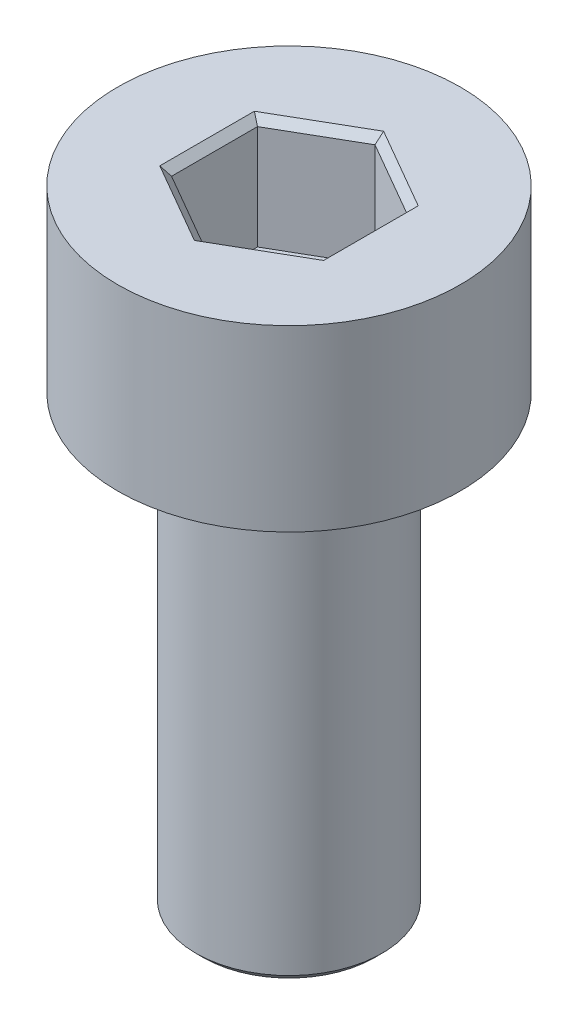
ISO-10303-21;
HEADER;
FILE_DESCRIPTION(('STEP AP214'),'2;1');
FILE_NAME('part.step','',(''),(''),'','','');
FILE_SCHEMA(('AUTOMOTIVE_DESIGN { 1 0 10303 214 1 1 1 1 }'));
ENDSEC;
DATA;
#1=APPLICATION_CONTEXT('core data for automotive mechanical design processes');
#2=APPLICATION_PROTOCOL_DEFINITION('international standard','automotive_design',2000,#1);
#3=PRODUCT_CONTEXT('',#1,'mechanical');
#4=PRODUCT('Part','Part','',(#3));
#5=PRODUCT_RELATED_PRODUCT_CATEGORY('part','',(#4));
#6=PRODUCT_DEFINITION_FORMATION('','',#4);
#7=PRODUCT_DEFINITION_CONTEXT('part definition',#1,'design');
#8=PRODUCT_DEFINITION('design','',#6,#7);
#9=PRODUCT_DEFINITION_SHAPE('','',#8);
#10=(LENGTH_UNIT() NAMED_UNIT(*) SI_UNIT(.MILLI.,.METRE.));
#11=(NAMED_UNIT(*) PLANE_ANGLE_UNIT() SI_UNIT($,.RADIAN.));
#12=(NAMED_UNIT(*) SI_UNIT($,.STERADIAN.) SOLID_ANGLE_UNIT());
#13=UNCERTAINTY_MEASURE_WITH_UNIT(LENGTH_MEASURE(1.E-05),#10,'distance_accuracy_value','');
#14=(GEOMETRIC_REPRESENTATION_CONTEXT(3) GLOBAL_UNCERTAINTY_ASSIGNED_CONTEXT((#13)) GLOBAL_UNIT_ASSIGNED_CONTEXT((#10,
#11,#12)) REPRESENTATION_CONTEXT('',''));
#15=CARTESIAN_POINT('',(0.,0.,0.));
#16=DIRECTION('',(0.,0.,1.));
#17=DIRECTION('',(1.,0.,0.));
#18=AXIS2_PLACEMENT_3D('',#15,#16,#17);
#19=CARTESIAN_POINT('',(0.,2.4,0.));
#20=DIRECTION('',(0.,-1.,0.));
#21=DIRECTION('',(0.,0.,-1.));
#22=AXIS2_PLACEMENT_3D('',#19,#20,#21);
#23=CYLINDRICAL_SURFACE('',#22,2.3);
#24=CARTESIAN_POINT('',(0.,2.4,0.));
#25=DIRECTION('',(0.,1.,0.));
#26=DIRECTION('',(0.,0.,1.));
#27=AXIS2_PLACEMENT_3D('',#24,#25,#26);
#28=CIRCLE('',#27,2.3);
#29=CARTESIAN_POINT('',(0.,2.4,2.3));
#30=VERTEX_POINT('',#29);
#31=EDGE_CURVE('E158',#30,#30,#28,.T.);
#32=ORIENTED_EDGE('',*,*,#31,.F.);
#33=EDGE_LOOP('',(#32));
#34=FACE_BOUND('',#33,.T.);
#35=CARTESIAN_POINT('',(0.,0.,0.));
#36=DIRECTION('',(0.,1.,0.));
#37=DIRECTION('',(0.,0.,1.));
#38=AXIS2_PLACEMENT_3D('',#35,#36,#37);
#39=CIRCLE('',#38,2.3);
#40=CARTESIAN_POINT('',(0.,0.,2.3));
#41=VERTEX_POINT('',#40);
#42=EDGE_CURVE('E147',#41,#41,#39,.T.);
#43=ORIENTED_EDGE('',*,*,#42,.T.);
#44=EDGE_LOOP('',(#43));
#45=FACE_BOUND('',#44,.T.);
#46=ADVANCED_FACE('F38',(#34,#45),#23,.T.);
#47=CARTESIAN_POINT('',(0.,2.4,0.));
#48=DIRECTION('',(0.,1.,0.));
#49=DIRECTION('',(0.,0.,1.));
#50=AXIS2_PLACEMENT_3D('',#47,#48,#49);
#51=PLANE('',#50);
#52=DIRECTION('',(0.866025403784439,0.,-0.5));
#53=VECTOR('',#52,1.);
#54=CARTESIAN_POINT('',(-0.0500000000000003,2.4,-1.2413030787577));
#55=LINE('',#54,#53);
#56=CARTESIAN_POINT('',(-1.1,2.4,-0.635085296108589));
#57=VERTEX_POINT('',#56);
#58=CARTESIAN_POINT('',(0.,2.4,-1.27017059221718));
#59=VERTEX_POINT('',#58);
#60=EDGE_CURVE('E174',#57,#59,#55,.T.);
#61=ORIENTED_EDGE('',*,*,#60,.T.);
#62=DIRECTION('',(0.866025403784439,0.,0.5));
#63=VECTOR('',#62,1.);
#64=CARTESIAN_POINT('',(1.05,2.4,-0.663952809568071));
#65=LINE('',#64,#63);
#66=CARTESIAN_POINT('',(1.1,2.4,-0.635085296108589));
#67=VERTEX_POINT('',#66);
#68=EDGE_CURVE('E176',#59,#67,#65,.T.);
#69=ORIENTED_EDGE('',*,*,#68,.T.);
#70=DIRECTION('',(0.,0.,1.));
#71=VECTOR('',#70,1.);
#72=CARTESIAN_POINT('',(1.1,2.4,0.577350269189626));
#73=LINE('',#72,#71);
#74=CARTESIAN_POINT('',(1.1,2.4,0.635085296108589));
#75=VERTEX_POINT('',#74);
#76=EDGE_CURVE('E166',#67,#75,#73,.T.);
#77=ORIENTED_EDGE('',*,*,#76,.T.);
#78=DIRECTION('',(-0.866025403784439,0.,0.5));
#79=VECTOR('',#78,1.);
#80=CARTESIAN_POINT('',(0.0499999999999994,2.4,1.2413030787577));
#81=LINE('',#80,#79);
#82=CARTESIAN_POINT('',(0.,2.4,1.27017059221718));
#83=VERTEX_POINT('',#82);
#84=EDGE_CURVE('E168',#75,#83,#81,.T.);
#85=ORIENTED_EDGE('',*,*,#84,.T.);
#86=DIRECTION('',(-0.866025403784439,0.,-0.5));
#87=VECTOR('',#86,1.);
#88=CARTESIAN_POINT('',(-1.05,2.4,0.66395280956807));
#89=LINE('',#88,#87);
#90=CARTESIAN_POINT('',(-1.1,2.4,0.635085296108588));
#91=VERTEX_POINT('',#90);
#92=EDGE_CURVE('E170',#83,#91,#89,.T.);
#93=ORIENTED_EDGE('',*,*,#92,.T.);
#94=DIRECTION('',(0.,0.,-1.));
#95=VECTOR('',#94,1.);
#96=CARTESIAN_POINT('',(-1.1,2.4,-0.577350269189626));
#97=LINE('',#96,#95);
#98=EDGE_CURVE('E172',#91,#57,#97,.T.);
#99=ORIENTED_EDGE('',*,*,#98,.T.);
#100=EDGE_LOOP('',(#61,#69,#77,#85,#93,#99));
#101=FACE_BOUND('',#100,.T.);
#102=ORIENTED_EDGE('',*,*,#31,.T.);
#103=EDGE_LOOP('',(#102));
#104=FACE_BOUND('',#103,.T.);
#105=ADVANCED_FACE('F235',(#101,#104),#51,.T.);
#106=CARTESIAN_POINT('',(0.,0.,0.));
#107=DIRECTION('',(0.,1.,0.));
#108=DIRECTION('',(0.,0.,1.));
#109=AXIS2_PLACEMENT_3D('',#106,#107,#108);
#110=PLANE('',#109);
#111=CARTESIAN_POINT('',(0.,0.,0.));
#112=DIRECTION('',(0.,-1.,0.));
#113=DIRECTION('',(0.,0.,-1.));
#114=AXIS2_PLACEMENT_3D('',#111,#112,#113);
#115=CIRCLE('',#114,1.25);
#116=CARTESIAN_POINT('',(0.,0.,-1.25));
#117=VERTEX_POINT('',#116);
#118=EDGE_CURVE('E136',#117,#117,#115,.T.);
#119=ORIENTED_EDGE('',*,*,#118,.F.);
#120=EDGE_LOOP('',(#119));
#121=FACE_BOUND('',#120,.T.);
#122=ORIENTED_EDGE('',*,*,#42,.F.);
#123=EDGE_LOOP('',(#122));
#124=FACE_BOUND('',#123,.T.);
#125=ADVANCED_FACE('F254',(#121,#124),#110,.F.);
#126=CARTESIAN_POINT('',(-1.,0.9,0.577350269189626));
#127=DIRECTION('',(-0.5,0.,0.866025403784439));
#128=DIRECTION('',(0.866025403784439,0.,0.5));
#129=AXIS2_PLACEMENT_3D('',#126,#127,#128);
#130=PLANE('',#129);
#131=DIRECTION('',(0.,1.,0.));
#132=VECTOR('',#131,1.);
#133=CARTESIAN_POINT('',(-1.,0.9,0.577350269189626));
#134=LINE('',#133,#132);
#135=CARTESIAN_POINT('',(-1.,0.9,0.577350269189626));
#136=VERTEX_POINT('',#135);
#137=CARTESIAN_POINT('',(-1.,2.3,0.577350269189626));
#138=VERTEX_POINT('',#137);
#139=EDGE_CURVE('E145',#136,#138,#134,.T.);
#140=ORIENTED_EDGE('',*,*,#139,.T.);
#141=DIRECTION('',(0.866025403784439,0.,0.5));
#142=VECTOR('',#141,1.);
#143=CARTESIAN_POINT('',(0.,2.3,1.15470053837925));
#144=LINE('',#143,#142);
#145=CARTESIAN_POINT('',(0.,2.3,1.15470053837925));
#146=VERTEX_POINT('',#145);
#147=EDGE_CURVE('E64',#138,#146,#144,.T.);
#148=ORIENTED_EDGE('',*,*,#147,.T.);
#149=DIRECTION('',(0.,1.,0.));
#150=VECTOR('',#149,1.);
#151=CARTESIAN_POINT('',(0.,0.9,1.15470053837925));
#152=LINE('',#151,#150);
#153=CARTESIAN_POINT('',(0.,0.9,1.15470053837925));
#154=VERTEX_POINT('',#153);
#155=EDGE_CURVE('E111',#154,#146,#152,.T.);
#156=ORIENTED_EDGE('',*,*,#155,.F.);
#157=DIRECTION('',(0.866025403784439,0.,0.5));
#158=VECTOR('',#157,1.);
#159=CARTESIAN_POINT('',(-1.,0.9,0.577350269189626));
#160=LINE('',#159,#158);
#161=EDGE_CURVE('E115',#136,#154,#160,.T.);
#162=ORIENTED_EDGE('',*,*,#161,.F.);
#163=EDGE_LOOP('',(#140,#148,#156,#162));
#164=FACE_BOUND('',#163,.T.);
#165=ADVANCED_FACE('F113',(#164),#130,.F.);
#166=CARTESIAN_POINT('',(-1.,0.9,-0.577350269189626));
#167=DIRECTION('',(-1.,0.,0.));
#168=DIRECTION('',(0.,0.,1.));
#169=AXIS2_PLACEMENT_3D('',#166,#167,#168);
#170=PLANE('',#169);
#171=DIRECTION('',(0.,1.,0.));
#172=VECTOR('',#171,1.);
#173=CARTESIAN_POINT('',(-1.,0.9,-0.577350269189626));
#174=LINE('',#173,#172);
#175=CARTESIAN_POINT('',(-1.,0.9,-0.577350269189626));
#176=VERTEX_POINT('',#175);
#177=CARTESIAN_POINT('',(-1.,2.3,-0.577350269189626));
#178=VERTEX_POINT('',#177);
#179=EDGE_CURVE('E148',#176,#178,#174,.T.);
#180=ORIENTED_EDGE('',*,*,#179,.T.);
#181=DIRECTION('',(0.,0.,1.));
#182=VECTOR('',#181,1.);
#183=CARTESIAN_POINT('',(-1.,2.3,0.577350269189626));
#184=LINE('',#183,#182);
#185=EDGE_CURVE('E181',#178,#138,#184,.T.);
#186=ORIENTED_EDGE('',*,*,#185,.T.);
#187=ORIENTED_EDGE('',*,*,#139,.F.);
#188=DIRECTION('',(0.,0.,1.));
#189=VECTOR('',#188,1.);
#190=CARTESIAN_POINT('',(-1.,0.9,-0.577350269189626));
#191=LINE('',#190,#189);
#192=EDGE_CURVE('E119',#176,#136,#191,.T.);
#193=ORIENTED_EDGE('',*,*,#192,.F.);
#194=EDGE_LOOP('',(#180,#186,#187,#193));
#195=FACE_BOUND('',#194,.T.);
#196=ADVANCED_FACE('F226',(#195),#170,.F.);
#197=CARTESIAN_POINT('',(0.,0.9,-1.15470053837925));
#198=DIRECTION('',(-0.5,0.,-0.866025403784439));
#199=DIRECTION('',(-0.866025403784439,0.,0.5));
#200=AXIS2_PLACEMENT_3D('',#197,#198,#199);
#201=PLANE('',#200);
#202=DIRECTION('',(0.,1.,0.));
#203=VECTOR('',#202,1.);
#204=CARTESIAN_POINT('',(0.,0.9,-1.15470053837925));
#205=LINE('',#204,#203);
#206=CARTESIAN_POINT('',(0.,0.9,-1.15470053837925));
#207=VERTEX_POINT('',#206);
#208=CARTESIAN_POINT('',(0.,2.3,-1.15470053837925));
#209=VERTEX_POINT('',#208);
#210=EDGE_CURVE('E151',#207,#209,#205,.T.);
#211=ORIENTED_EDGE('',*,*,#210,.T.);
#212=DIRECTION('',(-0.866025403784439,0.,0.5));
#213=VECTOR('',#212,1.);
#214=CARTESIAN_POINT('',(-1.,2.3,-0.577350269189626));
#215=LINE('',#214,#213);
#216=EDGE_CURVE('E179',#209,#178,#215,.T.);
#217=ORIENTED_EDGE('',*,*,#216,.T.);
#218=ORIENTED_EDGE('',*,*,#179,.F.);
#219=DIRECTION('',(-0.866025403784439,0.,0.5));
#220=VECTOR('',#219,1.);
#221=CARTESIAN_POINT('',(0.,0.9,-1.15470053837925));
#222=LINE('',#221,#220);
#223=EDGE_CURVE('E142',#207,#176,#222,.T.);
#224=ORIENTED_EDGE('',*,*,#223,.F.);
#225=EDGE_LOOP('',(#211,#217,#218,#224));
#226=FACE_BOUND('',#225,.T.);
#227=ADVANCED_FACE('F227',(#226),#201,.F.);
#228=CARTESIAN_POINT('',(0.999999999999999,0.9,-0.577350269189627));
#229=DIRECTION('',(0.5,0.,-0.866025403784439));
#230=DIRECTION('',(-0.866025403784439,0.,-0.5));
#231=AXIS2_PLACEMENT_3D('',#228,#229,#230);
#232=PLANE('',#231);
#233=DIRECTION('',(0.,1.,0.));
#234=VECTOR('',#233,1.);
#235=CARTESIAN_POINT('',(0.999999999999999,0.9,-0.577350269189627));
#236=LINE('',#235,#234);
#237=CARTESIAN_POINT('',(0.999999999999999,0.9,-0.577350269189627));
#238=VERTEX_POINT('',#237);
#239=CARTESIAN_POINT('',(0.999999999999999,2.3,-0.577350269189627));
#240=VERTEX_POINT('',#239);
#241=EDGE_CURVE('E154',#238,#240,#236,.T.);
#242=ORIENTED_EDGE('',*,*,#241,.T.);
#243=DIRECTION('',(-0.866025403784439,0.,-0.5));
#244=VECTOR('',#243,1.);
#245=CARTESIAN_POINT('',(0.,2.3,-1.15470053837925));
#246=LINE('',#245,#244);
#247=EDGE_CURVE('E163',#240,#209,#246,.T.);
#248=ORIENTED_EDGE('',*,*,#247,.T.);
#249=ORIENTED_EDGE('',*,*,#210,.F.);
#250=DIRECTION('',(-0.866025403784439,0.,-0.5));
#251=VECTOR('',#250,1.);
#252=CARTESIAN_POINT('',(0.999999999999999,0.9,-0.577350269189627));
#253=LINE('',#252,#251);
#254=EDGE_CURVE('E139',#238,#207,#253,.T.);
#255=ORIENTED_EDGE('',*,*,#254,.F.);
#256=EDGE_LOOP('',(#242,#248,#249,#255));
#257=FACE_BOUND('',#256,.T.);
#258=ADVANCED_FACE('F222',(#257),#232,.F.);
#259=CARTESIAN_POINT('',(1.,0.9,0.577350269189626));
#260=DIRECTION('',(1.,0.,0.));
#261=DIRECTION('',(0.,0.,-1.));
#262=AXIS2_PLACEMENT_3D('',#259,#260,#261);
#263=PLANE('',#262);
#264=DIRECTION('',(0.,1.,0.));
#265=VECTOR('',#264,1.);
#266=CARTESIAN_POINT('',(1.,0.9,0.577350269189626));
#267=LINE('',#266,#265);
#268=CARTESIAN_POINT('',(1.,0.9,0.577350269189626));
#269=VERTEX_POINT('',#268);
#270=CARTESIAN_POINT('',(1.,2.3,0.577350269189626));
#271=VERTEX_POINT('',#270);
#272=EDGE_CURVE('E118',#269,#271,#267,.T.);
#273=ORIENTED_EDGE('',*,*,#272,.T.);
#274=DIRECTION('',(0.,0.,-1.));
#275=VECTOR('',#274,1.);
#276=CARTESIAN_POINT('',(0.999999999999999,2.3,-0.577350269189627));
#277=LINE('',#276,#275);
#278=EDGE_CURVE('E185',#271,#240,#277,.T.);
#279=ORIENTED_EDGE('',*,*,#278,.T.);
#280=ORIENTED_EDGE('',*,*,#241,.F.);
#281=DIRECTION('',(0.,0.,-1.));
#282=VECTOR('',#281,1.);
#283=CARTESIAN_POINT('',(1.,0.9,0.577350269189626));
#284=LINE('',#283,#282);
#285=EDGE_CURVE('E127',#269,#238,#284,.T.);
#286=ORIENTED_EDGE('',*,*,#285,.F.);
#287=EDGE_LOOP('',(#273,#279,#280,#286));
#288=FACE_BOUND('',#287,.T.);
#289=ADVANCED_FACE('F219',(#288),#263,.F.);
#290=CARTESIAN_POINT('',(0.,0.9,1.15470053837925));
#291=DIRECTION('',(0.5,0.,0.866025403784439));
#292=DIRECTION('',(0.866025403784439,0.,-0.5));
#293=AXIS2_PLACEMENT_3D('',#290,#291,#292);
#294=PLANE('',#293);
#295=ORIENTED_EDGE('',*,*,#155,.T.);
#296=DIRECTION('',(0.866025403784439,0.,-0.5));
#297=VECTOR('',#296,1.);
#298=CARTESIAN_POINT('',(1.,2.3,0.577350269189626));
#299=LINE('',#298,#297);
#300=EDGE_CURVE('E56',#146,#271,#299,.T.);
#301=ORIENTED_EDGE('',*,*,#300,.T.);
#302=ORIENTED_EDGE('',*,*,#272,.F.);
#303=DIRECTION('',(0.866025403784439,0.,-0.5));
#304=VECTOR('',#303,1.);
#305=CARTESIAN_POINT('',(0.,0.9,1.15470053837925));
#306=LINE('',#305,#304);
#307=EDGE_CURVE('E122',#154,#269,#306,.T.);
#308=ORIENTED_EDGE('',*,*,#307,.F.);
#309=EDGE_LOOP('',(#295,#301,#302,#308));
#310=FACE_BOUND('',#309,.T.);
#311=ADVANCED_FACE('F123',(#310),#294,.F.);
#312=CARTESIAN_POINT('',(0.,0.9,0.));
#313=DIRECTION('',(0.,1.,0.));
#314=DIRECTION('',(0.,0.,1.));
#315=AXIS2_PLACEMENT_3D('',#312,#313,#314);
#316=PLANE('',#315);
#317=ORIENTED_EDGE('',*,*,#161,.T.);
#318=ORIENTED_EDGE('',*,*,#307,.T.);
#319=ORIENTED_EDGE('',*,*,#285,.T.);
#320=ORIENTED_EDGE('',*,*,#254,.T.);
#321=ORIENTED_EDGE('',*,*,#223,.T.);
#322=ORIENTED_EDGE('',*,*,#192,.T.);
#323=EDGE_LOOP('',(#317,#318,#319,#320,#321,#322));
#324=FACE_BOUND('',#323,.T.);
#325=ADVANCED_FACE('F129',(#324),#316,.T.);
#326=CARTESIAN_POINT('',(0.,-6.,0.));
#327=DIRECTION('',(0.,1.,0.));
#328=DIRECTION('',(0.,0.,1.));
#329=AXIS2_PLACEMENT_3D('',#326,#327,#328);
#330=CYLINDRICAL_SURFACE('',#329,1.25);
#331=CARTESIAN_POINT('',(0.,-5.9,0.));
#332=DIRECTION('',(0.,-1.,0.));
#333=DIRECTION('',(0.,0.,-1.));
#334=AXIS2_PLACEMENT_3D('',#331,#332,#333);
#335=CIRCLE('',#334,1.25);
#336=CARTESIAN_POINT('',(0.,-5.9,-1.25));
#337=VERTEX_POINT('',#336);
#338=EDGE_CURVE('E11',#337,#337,#335,.F.);
#339=ORIENTED_EDGE('',*,*,#338,.T.);
#340=EDGE_LOOP('',(#339));
#341=FACE_BOUND('',#340,.T.);
#342=ORIENTED_EDGE('',*,*,#118,.T.);
#343=EDGE_LOOP('',(#342));
#344=FACE_BOUND('',#343,.T.);
#345=ADVANCED_FACE('F276',(#341,#344),#330,.T.);
#346=CARTESIAN_POINT('',(0.,-6.,0.));
#347=DIRECTION('',(0.,-1.,0.));
#348=DIRECTION('',(0.,0.,-1.));
#349=AXIS2_PLACEMENT_3D('',#346,#347,#348);
#350=PLANE('',#349);
#351=CARTESIAN_POINT('',(0.,-6.,0.));
#352=DIRECTION('',(0.,-1.,0.));
#353=DIRECTION('',(0.,0.,-1.));
#354=AXIS2_PLACEMENT_3D('',#351,#352,#353);
#355=CIRCLE('',#354,1.15);
#356=CARTESIAN_POINT('',(0.,-6.,-1.15));
#357=VERTEX_POINT('',#356);
#358=EDGE_CURVE('E48',#357,#357,#355,.T.);
#359=ORIENTED_EDGE('',*,*,#358,.T.);
#360=EDGE_LOOP('',(#359));
#361=FACE_BOUND('',#360,.T.);
#362=ADVANCED_FACE('F279',(#361),#350,.T.);
#363=CARTESIAN_POINT('',(-1.,2.3,0.577350269189626));
#364=DIRECTION('',(0.353553390593274,0.707106781186548,-0.612372435695794));
#365=DIRECTION('',(-0.866025403784439,0.,-0.5));
#366=AXIS2_PLACEMENT_3D('',#363,#364,#365);
#367=PLANE('',#366);
#368=DIRECTION('',(-0.654653670707977,0.654653670707977,0.377964473009228));
#369=VECTOR('',#368,1.);
#370=CARTESIAN_POINT('',(-0.714285714285714,2.01428571428571,0.412393049421161));
#371=LINE('',#370,#369);
#372=EDGE_CURVE('E134',#91,#138,#371,.F.);
#373=ORIENTED_EDGE('',*,*,#372,.F.);
#374=ORIENTED_EDGE('',*,*,#92,.F.);
#375=DIRECTION('',(0.,0.654653670707977,0.755928946018455));
#376=VECTOR('',#375,1.);
#377=CARTESIAN_POINT('',(0.,2.01428571428571,0.824786098842323));
#378=LINE('',#377,#376);
#379=EDGE_CURVE('E43',#146,#83,#378,.T.);
#380=ORIENTED_EDGE('',*,*,#379,.F.);
#381=ORIENTED_EDGE('',*,*,#147,.F.);
#382=EDGE_LOOP('',(#373,#374,#380,#381));
#383=FACE_BOUND('',#382,.T.);
#384=ADVANCED_FACE('F207',(#383),#367,.T.);
#385=CARTESIAN_POINT('',(0.,2.3,1.15470053837925));
#386=DIRECTION('',(-0.353553390593273,0.707106781186547,-0.612372435695795));
#387=DIRECTION('',(-0.866025403784439,0.,0.5));
#388=AXIS2_PLACEMENT_3D('',#385,#386,#387);
#389=PLANE('',#388);
#390=ORIENTED_EDGE('',*,*,#379,.T.);
#391=ORIENTED_EDGE('',*,*,#84,.F.);
#392=DIRECTION('',(0.654653670707978,0.654653670707977,0.377964473009227));
#393=VECTOR('',#392,1.);
#394=CARTESIAN_POINT('',(0.714285714285713,2.01428571428571,0.412393049421161));
#395=LINE('',#394,#393);
#396=EDGE_CURVE('E196',#271,#75,#395,.T.);
#397=ORIENTED_EDGE('',*,*,#396,.F.);
#398=ORIENTED_EDGE('',*,*,#300,.F.);
#399=EDGE_LOOP('',(#390,#391,#397,#398));
#400=FACE_BOUND('',#399,.T.);
#401=ADVANCED_FACE('F211',(#400),#389,.T.);
#402=CARTESIAN_POINT('',(-1.,2.3,-0.577350269189626));
#403=DIRECTION('',(0.707106781186547,0.707106781186547,0.));
#404=DIRECTION('',(0.,0.,-1.));
#405=AXIS2_PLACEMENT_3D('',#402,#403,#404);
#406=PLANE('',#405);
#407=ORIENTED_EDGE('',*,*,#372,.T.);
#408=ORIENTED_EDGE('',*,*,#185,.F.);
#409=DIRECTION('',(-0.654653670707977,0.654653670707977,-0.377964473009227));
#410=VECTOR('',#409,1.);
#411=CARTESIAN_POINT('',(-0.714285714285714,2.01428571428571,-0.412393049421162));
#412=LINE('',#411,#410);
#413=EDGE_CURVE('E193',#57,#178,#412,.F.);
#414=ORIENTED_EDGE('',*,*,#413,.F.);
#415=ORIENTED_EDGE('',*,*,#98,.F.);
#416=EDGE_LOOP('',(#407,#408,#414,#415));
#417=FACE_BOUND('',#416,.T.);
#418=ADVANCED_FACE('F203',(#417),#406,.T.);
#419=CARTESIAN_POINT('',(1.,2.3,0.577350269189626));
#420=DIRECTION('',(-0.707106781186547,0.707106781186548,0.));
#421=DIRECTION('',(0.,0.,1.));
#422=AXIS2_PLACEMENT_3D('',#419,#420,#421);
#423=PLANE('',#422);
#424=ORIENTED_EDGE('',*,*,#396,.T.);
#425=ORIENTED_EDGE('',*,*,#76,.F.);
#426=DIRECTION('',(-0.654653670707977,-0.654653670707977,0.377964473009227));
#427=VECTOR('',#426,1.);
#428=CARTESIAN_POINT('',(0.999999999999999,2.3,-0.577350269189627));
#429=LINE('',#428,#427);
#430=EDGE_CURVE('E191',#240,#67,#429,.F.);
#431=ORIENTED_EDGE('',*,*,#430,.F.);
#432=ORIENTED_EDGE('',*,*,#278,.F.);
#433=EDGE_LOOP('',(#424,#425,#431,#432));
#434=FACE_BOUND('',#433,.T.);
#435=ADVANCED_FACE('F216',(#434),#423,.T.);
#436=CARTESIAN_POINT('',(0.,2.3,-1.15470053837925));
#437=DIRECTION('',(0.353553390593274,0.707106781186547,0.612372435695795));
#438=DIRECTION('',(0.866025403784439,0.,-0.5));
#439=AXIS2_PLACEMENT_3D('',#436,#437,#438);
#440=PLANE('',#439);
#441=ORIENTED_EDGE('',*,*,#413,.T.);
#442=ORIENTED_EDGE('',*,*,#216,.F.);
#443=DIRECTION('',(0.,0.654653670707977,-0.755928946018454));
#444=VECTOR('',#443,1.);
#445=CARTESIAN_POINT('',(0.,2.01428571428571,-0.824786098842324));
#446=LINE('',#445,#444);
#447=EDGE_CURVE('E189',#59,#209,#446,.F.);
#448=ORIENTED_EDGE('',*,*,#447,.F.);
#449=ORIENTED_EDGE('',*,*,#60,.F.);
#450=EDGE_LOOP('',(#441,#442,#448,#449));
#451=FACE_BOUND('',#450,.T.);
#452=ADVANCED_FACE('F231',(#451),#440,.T.);
#453=CARTESIAN_POINT('',(0.999999999999999,2.3,-0.577350269189627));
#454=DIRECTION('',(-0.353553390593274,0.707106781186548,0.612372435695794));
#455=DIRECTION('',(0.866025403784439,0.,0.5));
#456=AXIS2_PLACEMENT_3D('',#453,#454,#455);
#457=PLANE('',#456);
#458=ORIENTED_EDGE('',*,*,#430,.T.);
#459=ORIENTED_EDGE('',*,*,#68,.F.);
#460=ORIENTED_EDGE('',*,*,#447,.T.);
#461=ORIENTED_EDGE('',*,*,#247,.F.);
#462=EDGE_LOOP('',(#458,#459,#460,#461));
#463=FACE_BOUND('',#462,.T.);
#464=ADVANCED_FACE('F238',(#463),#457,.T.);
#465=CARTESIAN_POINT('',(0.,-6.,0.));
#466=DIRECTION('',(0.,1.,0.));
#467=DIRECTION('',(0.,0.,1.));
#468=AXIS2_PLACEMENT_3D('',#465,#466,#467);
#469=CONICAL_SURFACE('',#468,1.15,0.785398163397447);
#470=ORIENTED_EDGE('',*,*,#338,.F.);
#471=EDGE_LOOP('',(#470));
#472=FACE_BOUND('',#471,.T.);
#473=ORIENTED_EDGE('',*,*,#358,.F.);
#474=EDGE_LOOP('',(#473));
#475=FACE_BOUND('',#474,.T.);
#476=ADVANCED_FACE('F41',(#472,#475),#469,.T.);
#477=CLOSED_SHELL('',(#46,#105,#125,#165,#196,#227,#258,#289,#311,#325,#345,#362,#384,#401,#418,
#435,#452,#464,#476));
#478=MANIFOLD_SOLID_BREP('B2',#477);
#479=ADVANCED_BREP_SHAPE_REPRESENTATION('',(#18,#478),#14);
#480=SHAPE_DEFINITION_REPRESENTATION(#9,#479);
ENDSEC;
END-ISO-10303-21;
